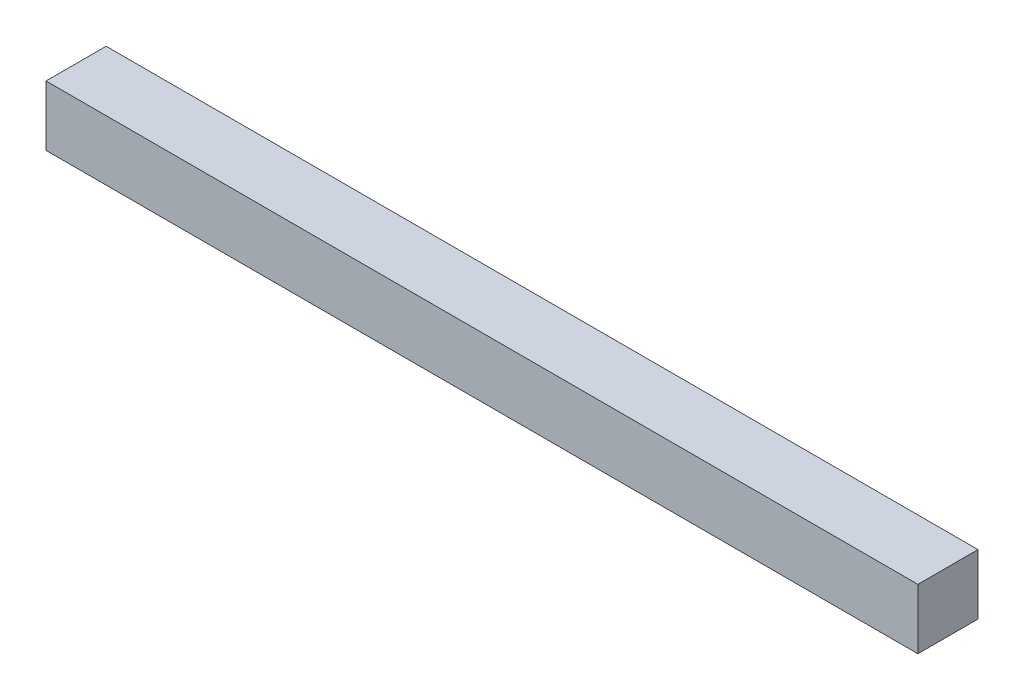
ISO-10303-21;
HEADER;
FILE_DESCRIPTION(('STEP AP214'),'2;1');
FILE_NAME('part.step','',(''),(''),'','','');
FILE_SCHEMA(('AUTOMOTIVE_DESIGN { 1 0 10303 214 1 1 1 1 }'));
ENDSEC;
DATA;
#1=APPLICATION_CONTEXT('core data for automotive mechanical design processes');
#2=APPLICATION_PROTOCOL_DEFINITION('international standard','automotive_design',2000,#1);
#3=PRODUCT_CONTEXT('',#1,'mechanical');
#4=PRODUCT('Part','Part','',(#3));
#5=PRODUCT_RELATED_PRODUCT_CATEGORY('part','',(#4));
#6=PRODUCT_DEFINITION_FORMATION('','',#4);
#7=PRODUCT_DEFINITION_CONTEXT('part definition',#1,'design');
#8=PRODUCT_DEFINITION('design','',#6,#7);
#9=PRODUCT_DEFINITION_SHAPE('','',#8);
#10=(LENGTH_UNIT() NAMED_UNIT(*) SI_UNIT(.MILLI.,.METRE.));
#11=(NAMED_UNIT(*) PLANE_ANGLE_UNIT() SI_UNIT($,.RADIAN.));
#12=(NAMED_UNIT(*) SI_UNIT($,.STERADIAN.) SOLID_ANGLE_UNIT());
#13=UNCERTAINTY_MEASURE_WITH_UNIT(LENGTH_MEASURE(1.E-05),#10,'distance_accuracy_value','');
#14=(GEOMETRIC_REPRESENTATION_CONTEXT(3) GLOBAL_UNCERTAINTY_ASSIGNED_CONTEXT((#13)) GLOBAL_UNIT_ASSIGNED_CONTEXT((#10,
#11,#12)) REPRESENTATION_CONTEXT('',''));
#15=CARTESIAN_POINT('',(0.,0.,0.));
#16=DIRECTION('',(0.,0.,1.));
#17=DIRECTION('',(1.,0.,0.));
#18=AXIS2_PLACEMENT_3D('',#15,#16,#17);
#19=CARTESIAN_POINT('',(0.,3.175,0.));
#20=DIRECTION('',(-1.,0.,0.));
#21=DIRECTION('',(0.,0.,1.));
#22=AXIS2_PLACEMENT_3D('',#19,#20,#21);
#23=PLANE('',#22);
#24=DIRECTION('',(0.,0.,-1.));
#25=VECTOR('',#24,1.);
#26=CARTESIAN_POINT('',(0.,0.,0.));
#27=LINE('',#26,#25);
#28=CARTESIAN_POINT('',(0.,0.,0.));
#29=VERTEX_POINT('',#28);
#30=CARTESIAN_POINT('',(0.,0.,-3.175));
#31=VERTEX_POINT('',#30);
#32=EDGE_CURVE('E96',#29,#31,#27,.T.);
#33=ORIENTED_EDGE('',*,*,#32,.T.);
#34=DIRECTION('',(0.,-1.,0.));
#35=VECTOR('',#34,1.);
#36=CARTESIAN_POINT('',(0.,3.175,-3.175));
#37=LINE('',#36,#35);
#38=CARTESIAN_POINT('',(0.,3.175,-3.175));
#39=VERTEX_POINT('',#38);
#40=EDGE_CURVE('E11',#39,#31,#37,.T.);
#41=ORIENTED_EDGE('',*,*,#40,.F.);
#42=DIRECTION('',(0.,0.,-1.));
#43=VECTOR('',#42,1.);
#44=CARTESIAN_POINT('',(0.,3.175,0.));
#45=LINE('',#44,#43);
#46=CARTESIAN_POINT('',(0.,3.175,0.));
#47=VERTEX_POINT('',#46);
#48=EDGE_CURVE('E84',#47,#39,#45,.T.);
#49=ORIENTED_EDGE('',*,*,#48,.F.);
#50=DIRECTION('',(0.,-1.,0.));
#51=VECTOR('',#50,1.);
#52=CARTESIAN_POINT('',(0.,3.175,0.));
#53=LINE('',#52,#51);
#54=EDGE_CURVE('E92',#47,#29,#53,.T.);
#55=ORIENTED_EDGE('',*,*,#54,.T.);
#56=EDGE_LOOP('',(#33,#41,#49,#55));
#57=FACE_BOUND('',#56,.T.);
#58=ADVANCED_FACE('F33',(#57),#23,.F.);
#59=CARTESIAN_POINT('',(0.,3.175,-3.175));
#60=DIRECTION('',(0.,0.,1.));
#61=DIRECTION('',(1.,0.,0.));
#62=AXIS2_PLACEMENT_3D('',#59,#60,#61);
#63=PLANE('',#62);
#64=DIRECTION('',(-1.,0.,0.));
#65=VECTOR('',#64,1.);
#66=CARTESIAN_POINT('',(0.,0.,-3.175));
#67=LINE('',#66,#65);
#68=CARTESIAN_POINT('',(-46.03496,0.,-3.17499999999999));
#69=VERTEX_POINT('',#68);
#70=EDGE_CURVE('E88',#31,#69,#67,.T.);
#71=ORIENTED_EDGE('',*,*,#70,.T.);
#72=DIRECTION('',(0.,-1.,0.));
#73=VECTOR('',#72,1.);
#74=CARTESIAN_POINT('',(-46.03496,3.175,-3.17499999999999));
#75=LINE('',#74,#73);
#76=CARTESIAN_POINT('',(-46.03496,3.175,-3.17499999999999));
#77=VERTEX_POINT('',#76);
#78=EDGE_CURVE('E41',#77,#69,#75,.T.);
#79=ORIENTED_EDGE('',*,*,#78,.F.);
#80=DIRECTION('',(-1.,0.,0.));
#81=VECTOR('',#80,1.);
#82=CARTESIAN_POINT('',(0.,3.175,-3.175));
#83=LINE('',#82,#81);
#84=EDGE_CURVE('E79',#39,#77,#83,.T.);
#85=ORIENTED_EDGE('',*,*,#84,.F.);
#86=ORIENTED_EDGE('',*,*,#40,.T.);
#87=EDGE_LOOP('',(#71,#79,#85,#86));
#88=FACE_BOUND('',#87,.T.);
#89=ADVANCED_FACE('F87',(#88),#63,.F.);
#90=CARTESIAN_POINT('',(-46.03496,3.175,0.));
#91=DIRECTION('',(1.,0.,0.));
#92=DIRECTION('',(0.,0.,-1.));
#93=AXIS2_PLACEMENT_3D('',#90,#91,#92);
#94=PLANE('',#93);
#95=DIRECTION('',(0.,0.,1.));
#96=VECTOR('',#95,1.);
#97=CARTESIAN_POINT('',(-46.03496,0.,0.));
#98=LINE('',#97,#96);
#99=CARTESIAN_POINT('',(-46.03496,0.,0.));
#100=VERTEX_POINT('',#99);
#101=EDGE_CURVE('E66',#69,#100,#98,.T.);
#102=ORIENTED_EDGE('',*,*,#101,.T.);
#103=DIRECTION('',(0.,-1.,0.));
#104=VECTOR('',#103,1.);
#105=CARTESIAN_POINT('',(-46.03496,3.175,0.));
#106=LINE('',#105,#104);
#107=CARTESIAN_POINT('',(-46.03496,3.175,0.));
#108=VERTEX_POINT('',#107);
#109=EDGE_CURVE('E89',#108,#100,#106,.T.);
#110=ORIENTED_EDGE('',*,*,#109,.F.);
#111=DIRECTION('',(0.,0.,1.));
#112=VECTOR('',#111,1.);
#113=CARTESIAN_POINT('',(-46.03496,3.175,0.));
#114=LINE('',#113,#112);
#115=EDGE_CURVE('E82',#77,#108,#114,.T.);
#116=ORIENTED_EDGE('',*,*,#115,.F.);
#117=ORIENTED_EDGE('',*,*,#78,.T.);
#118=EDGE_LOOP('',(#102,#110,#116,#117));
#119=FACE_BOUND('',#118,.T.);
#120=ADVANCED_FACE('F90',(#119),#94,.F.);
#121=CARTESIAN_POINT('',(0.,3.175,0.));
#122=DIRECTION('',(0.,0.,-1.));
#123=DIRECTION('',(-1.,0.,0.));
#124=AXIS2_PLACEMENT_3D('',#121,#122,#123);
#125=PLANE('',#124);
#126=DIRECTION('',(1.,0.,0.));
#127=VECTOR('',#126,1.);
#128=CARTESIAN_POINT('',(0.,0.,0.));
#129=LINE('',#128,#127);
#130=EDGE_CURVE('E72',#100,#29,#129,.T.);
#131=ORIENTED_EDGE('',*,*,#130,.T.);
#132=ORIENTED_EDGE('',*,*,#54,.F.);
#133=DIRECTION('',(1.,0.,0.));
#134=VECTOR('',#133,1.);
#135=CARTESIAN_POINT('',(0.,3.175,0.));
#136=LINE('',#135,#134);
#137=EDGE_CURVE('E49',#108,#47,#136,.T.);
#138=ORIENTED_EDGE('',*,*,#137,.F.);
#139=ORIENTED_EDGE('',*,*,#109,.T.);
#140=EDGE_LOOP('',(#131,#132,#138,#139));
#141=FACE_BOUND('',#140,.T.);
#142=ADVANCED_FACE('F103',(#141),#125,.F.);
#143=CARTESIAN_POINT('',(0.,3.175,0.));
#144=DIRECTION('',(0.,1.,0.));
#145=DIRECTION('',(0.,0.,1.));
#146=AXIS2_PLACEMENT_3D('',#143,#144,#145);
#147=PLANE('',#146);
#148=ORIENTED_EDGE('',*,*,#48,.T.);
#149=ORIENTED_EDGE('',*,*,#84,.T.);
#150=ORIENTED_EDGE('',*,*,#115,.T.);
#151=ORIENTED_EDGE('',*,*,#137,.T.);
#152=EDGE_LOOP('',(#148,#149,#150,#151));
#153=FACE_BOUND('',#152,.T.);
#154=ADVANCED_FACE('F80',(#153),#147,.T.);
#155=CARTESIAN_POINT('',(0.,0.,0.));
#156=DIRECTION('',(0.,1.,0.));
#157=DIRECTION('',(0.,0.,1.));
#158=AXIS2_PLACEMENT_3D('',#155,#156,#157);
#159=PLANE('',#158);
#160=ORIENTED_EDGE('',*,*,#32,.F.);
#161=ORIENTED_EDGE('',*,*,#130,.F.);
#162=ORIENTED_EDGE('',*,*,#101,.F.);
#163=ORIENTED_EDGE('',*,*,#70,.F.);
#164=EDGE_LOOP('',(#160,#161,#162,#163));
#165=FACE_BOUND('',#164,.T.);
#166=ADVANCED_FACE('F106',(#165),#159,.F.);
#167=CLOSED_SHELL('',(#58,#89,#120,#142,#154,#166));
#168=MANIFOLD_SOLID_BREP('B2',#167);
#169=ADVANCED_BREP_SHAPE_REPRESENTATION('',(#18,#168),#14);
#170=SHAPE_DEFINITION_REPRESENTATION(#9,#169);
ENDSEC;
END-ISO-10303-21;
